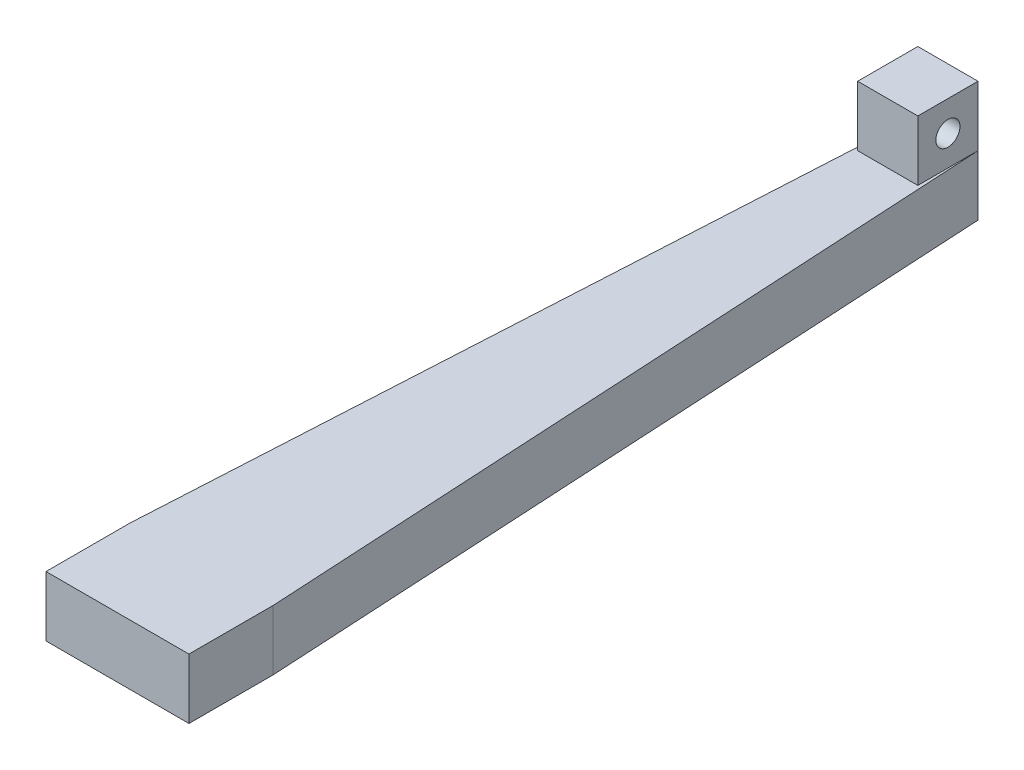
ISO-10303-21;
HEADER;
FILE_DESCRIPTION(('STEP AP214'),'2;1');
FILE_NAME('part.step','',(''),(''),'','','');
FILE_SCHEMA(('AUTOMOTIVE_DESIGN { 1 0 10303 214 1 1 1 1 }'));
ENDSEC;
DATA;
#1=APPLICATION_CONTEXT('core data for automotive mechanical design processes');
#2=APPLICATION_PROTOCOL_DEFINITION('international standard','automotive_design',2000,#1);
#3=PRODUCT_CONTEXT('',#1,'mechanical');
#4=PRODUCT('Part','Part','',(#3));
#5=PRODUCT_RELATED_PRODUCT_CATEGORY('part','',(#4));
#6=PRODUCT_DEFINITION_FORMATION('','',#4);
#7=PRODUCT_DEFINITION_CONTEXT('part definition',#1,'design');
#8=PRODUCT_DEFINITION('design','',#6,#7);
#9=PRODUCT_DEFINITION_SHAPE('','',#8);
#10=(LENGTH_UNIT() NAMED_UNIT(*) SI_UNIT(.MILLI.,.METRE.));
#11=(NAMED_UNIT(*) PLANE_ANGLE_UNIT() SI_UNIT($,.RADIAN.));
#12=(NAMED_UNIT(*) SI_UNIT($,.STERADIAN.) SOLID_ANGLE_UNIT());
#13=UNCERTAINTY_MEASURE_WITH_UNIT(LENGTH_MEASURE(1.E-05),#10,'distance_accuracy_value','');
#14=(GEOMETRIC_REPRESENTATION_CONTEXT(3) GLOBAL_UNCERTAINTY_ASSIGNED_CONTEXT((#13)) GLOBAL_UNIT_ASSIGNED_CONTEXT((#10,
#11,#12)) REPRESENTATION_CONTEXT('',''));
#15=CARTESIAN_POINT('',(0.,0.,0.));
#16=DIRECTION('',(0.,0.,1.));
#17=DIRECTION('',(1.,0.,0.));
#18=AXIS2_PLACEMENT_3D('',#15,#16,#17);
#19=CARTESIAN_POINT('',(0.,-4.72649901887386,0.));
#20=DIRECTION('',(0.,-1.,0.));
#21=DIRECTION('',(0.,0.,-1.));
#22=AXIS2_PLACEMENT_3D('',#19,#20,#21);
#23=PLANE('',#22);
#24=DIRECTION('',(0.,0.,1.));
#25=VECTOR('',#24,1.);
#26=CARTESIAN_POINT('',(-6.25,-4.72649901887386,-86.275));
#27=LINE('',#26,#25);
#28=CARTESIAN_POINT('',(-6.25,-4.72649901887386,-86.275));
#29=VERTEX_POINT('',#28);
#30=CARTESIAN_POINT('',(-6.25,-4.72649901887386,-73.775));
#31=VERTEX_POINT('',#30);
#32=EDGE_CURVE('E75',#29,#31,#27,.T.);
#33=ORIENTED_EDGE('',*,*,#32,.F.);
#34=DIRECTION('',(-0.0553808552337029,0.,0.998465302789027));
#35=VECTOR('',#34,1.);
#36=CARTESIAN_POINT('',(-11.0014815331256,-4.72649901887386,-0.610207940566787));
#37=LINE('',#36,#35);
#38=CARTESIAN_POINT('',(-14.85,-4.72649901887386,68.775));
#39=VERTEX_POINT('',#38);
#40=EDGE_CURVE('E122',#29,#39,#37,.T.);
#41=ORIENTED_EDGE('',*,*,#40,.T.);
#42=DIRECTION('',(0.,0.,1.));
#43=VECTOR('',#42,1.);
#44=CARTESIAN_POINT('',(-14.85,-4.72649901887386,0.));
#45=LINE('',#44,#43);
#46=CARTESIAN_POINT('',(-14.85,-4.72649901887386,86.275));
#47=VERTEX_POINT('',#46);
#48=EDGE_CURVE('E117',#39,#47,#45,.T.);
#49=ORIENTED_EDGE('',*,*,#48,.T.);
#50=DIRECTION('',(1.,0.,0.));
#51=VECTOR('',#50,1.);
#52=CARTESIAN_POINT('',(0.,-4.72649901887386,86.275));
#53=LINE('',#52,#51);
#54=CARTESIAN_POINT('',(14.85,-4.72649901887386,86.275));
#55=VERTEX_POINT('',#54);
#56=EDGE_CURVE('E120',#47,#55,#53,.T.);
#57=ORIENTED_EDGE('',*,*,#56,.T.);
#58=DIRECTION('',(0.,0.,-1.));
#59=VECTOR('',#58,1.);
#60=CARTESIAN_POINT('',(14.85,-4.72649901887386,0.));
#61=LINE('',#60,#59);
#62=CARTESIAN_POINT('',(14.85,-4.72649901887386,68.775));
#63=VERTEX_POINT('',#62);
#64=EDGE_CURVE('E139',#55,#63,#61,.T.);
#65=ORIENTED_EDGE('',*,*,#64,.T.);
#66=DIRECTION('',(-0.0553808552337029,0.,-0.998465302789027));
#67=VECTOR('',#66,1.);
#68=CARTESIAN_POINT('',(11.0014815331256,-4.72649901887386,-0.610207940566787));
#69=LINE('',#68,#67);
#70=CARTESIAN_POINT('',(6.25,-4.72649901887386,-86.275));
#71=VERTEX_POINT('',#70);
#72=EDGE_CURVE('E106',#63,#71,#69,.T.);
#73=ORIENTED_EDGE('',*,*,#72,.T.);
#74=DIRECTION('',(0.,0.,-1.));
#75=VECTOR('',#74,1.);
#76=CARTESIAN_POINT('',(6.25,-4.72649901887386,-86.275));
#77=LINE('',#76,#75);
#78=CARTESIAN_POINT('',(6.25,-4.72649901887386,-73.775));
#79=VERTEX_POINT('',#78);
#80=EDGE_CURVE('E194',#79,#71,#77,.T.);
#81=ORIENTED_EDGE('',*,*,#80,.F.);
#82=DIRECTION('',(1.,0.,0.));
#83=VECTOR('',#82,1.);
#84=CARTESIAN_POINT('',(-6.25,-4.72649901887386,-73.775));
#85=LINE('',#84,#83);
#86=EDGE_CURVE('E69',#31,#79,#85,.T.);
#87=ORIENTED_EDGE('',*,*,#86,.F.);
#88=EDGE_LOOP('',(#33,#41,#49,#57,#65,#73,#81,#87));
#89=FACE_BOUND('',#88,.T.);
#90=ADVANCED_FACE('F52',(#89),#23,.F.);
#91=CARTESIAN_POINT('',(0.,-4.72649901887386,-86.275));
#92=DIRECTION('',(0.,0.,-1.));
#93=DIRECTION('',(-1.,0.,0.));
#94=AXIS2_PLACEMENT_3D('',#91,#92,#93);
#95=PLANE('',#94);
#96=DIRECTION('',(1.,0.,0.));
#97=VECTOR('',#96,1.);
#98=CARTESIAN_POINT('',(0.,-17.2264990188739,-86.275));
#99=LINE('',#98,#97);
#100=CARTESIAN_POINT('',(-6.25,-17.2264990188739,-86.275));
#101=VERTEX_POINT('',#100);
#102=CARTESIAN_POINT('',(6.25,-17.2264990188739,-86.275));
#103=VERTEX_POINT('',#102);
#104=EDGE_CURVE('E145',#101,#103,#99,.T.);
#105=ORIENTED_EDGE('',*,*,#104,.F.);
#106=DIRECTION('',(0.,-1.,0.));
#107=VECTOR('',#106,1.);
#108=CARTESIAN_POINT('',(-6.25,-4.72649901887386,-86.275));
#109=LINE('',#108,#107);
#110=EDGE_CURVE('E12',#29,#101,#109,.T.);
#111=ORIENTED_EDGE('',*,*,#110,.F.);
#112=DIRECTION('',(0.,-1.,0.));
#113=VECTOR('',#112,1.);
#114=CARTESIAN_POINT('',(-6.25,7.77350098112614,-86.275));
#115=LINE('',#114,#113);
#116=CARTESIAN_POINT('',(-6.25,7.77350098112614,-86.275));
#117=VERTEX_POINT('',#116);
#118=EDGE_CURVE('E181',#117,#29,#115,.T.);
#119=ORIENTED_EDGE('',*,*,#118,.F.);
#120=DIRECTION('',(-1.,0.,0.));
#121=VECTOR('',#120,1.);
#122=CARTESIAN_POINT('',(-6.25,7.77350098112614,-86.275));
#123=LINE('',#122,#121);
#124=CARTESIAN_POINT('',(6.25,7.77350098112614,-86.275));
#125=VERTEX_POINT('',#124);
#126=EDGE_CURVE('E186',#125,#117,#123,.T.);
#127=ORIENTED_EDGE('',*,*,#126,.F.);
#128=DIRECTION('',(0.,-1.,0.));
#129=VECTOR('',#128,1.);
#130=CARTESIAN_POINT('',(6.25,7.77350098112614,-86.275));
#131=LINE('',#130,#129);
#132=EDGE_CURVE('E170',#125,#71,#131,.T.);
#133=ORIENTED_EDGE('',*,*,#132,.T.);
#134=DIRECTION('',(0.,-1.,0.));
#135=VECTOR('',#134,1.);
#136=CARTESIAN_POINT('',(6.25,-4.72649901887386,-86.275));
#137=LINE('',#136,#135);
#138=EDGE_CURVE('E56',#71,#103,#137,.T.);
#139=ORIENTED_EDGE('',*,*,#138,.T.);
#140=EDGE_LOOP('',(#105,#111,#119,#127,#133,#139));
#141=FACE_BOUND('',#140,.T.);
#142=ADVANCED_FACE('F54',(#141),#95,.T.);
#143=CARTESIAN_POINT('',(-11.0014815331256,-4.72649901887386,-0.610207940566787));
#144=DIRECTION('',(0.998465302789027,0.,0.0553808552337029));
#145=DIRECTION('',(0.0553808552337029,0.,-0.998465302789027));
#146=AXIS2_PLACEMENT_3D('',#143,#144,#145);
#147=PLANE('',#146);
#148=DIRECTION('',(-0.0553808552337029,0.,0.998465302789027));
#149=VECTOR('',#148,1.);
#150=CARTESIAN_POINT('',(-11.0014815331256,-17.2264990188739,-0.610207940566787));
#151=LINE('',#150,#149);
#152=CARTESIAN_POINT('',(-14.85,-17.2264990188739,68.775));
#153=VERTEX_POINT('',#152);
#154=EDGE_CURVE('E157',#101,#153,#151,.T.);
#155=ORIENTED_EDGE('',*,*,#154,.T.);
#156=DIRECTION('',(0.,-1.,0.));
#157=VECTOR('',#156,1.);
#158=CARTESIAN_POINT('',(-14.85,-4.72649901887386,68.775));
#159=LINE('',#158,#157);
#160=EDGE_CURVE('E61',#39,#153,#159,.T.);
#161=ORIENTED_EDGE('',*,*,#160,.F.);
#162=ORIENTED_EDGE('',*,*,#40,.F.);
#163=ORIENTED_EDGE('',*,*,#110,.T.);
#164=EDGE_LOOP('',(#155,#161,#162,#163));
#165=FACE_BOUND('',#164,.T.);
#166=ADVANCED_FACE('F176',(#165),#147,.F.);
#167=CARTESIAN_POINT('',(-14.85,-4.72649901887386,0.));
#168=DIRECTION('',(1.,0.,0.));
#169=DIRECTION('',(0.,0.,-1.));
#170=AXIS2_PLACEMENT_3D('',#167,#168,#169);
#171=PLANE('',#170);
#172=DIRECTION('',(0.,0.,1.));
#173=VECTOR('',#172,1.);
#174=CARTESIAN_POINT('',(-14.85,-17.2264990188739,0.));
#175=LINE('',#174,#173);
#176=CARTESIAN_POINT('',(-14.85,-17.2264990188739,86.275));
#177=VERTEX_POINT('',#176);
#178=EDGE_CURVE('E131',#153,#177,#175,.T.);
#179=ORIENTED_EDGE('',*,*,#178,.T.);
#180=DIRECTION('',(0.,-1.,0.));
#181=VECTOR('',#180,1.);
#182=CARTESIAN_POINT('',(-14.85,-4.72649901887386,86.275));
#183=LINE('',#182,#181);
#184=EDGE_CURVE('E128',#47,#177,#183,.T.);
#185=ORIENTED_EDGE('',*,*,#184,.F.);
#186=ORIENTED_EDGE('',*,*,#48,.F.);
#187=ORIENTED_EDGE('',*,*,#160,.T.);
#188=EDGE_LOOP('',(#179,#185,#186,#187));
#189=FACE_BOUND('',#188,.T.);
#190=ADVANCED_FACE('F129',(#189),#171,.F.);
#191=CARTESIAN_POINT('',(0.,-4.72649901887386,86.275));
#192=DIRECTION('',(0.,0.,-1.));
#193=DIRECTION('',(-1.,0.,0.));
#194=AXIS2_PLACEMENT_3D('',#191,#192,#193);
#195=PLANE('',#194);
#196=DIRECTION('',(1.,0.,0.));
#197=VECTOR('',#196,1.);
#198=CARTESIAN_POINT('',(0.,-17.2264990188739,86.275));
#199=LINE('',#198,#197);
#200=CARTESIAN_POINT('',(14.85,-17.2264990188739,86.275));
#201=VERTEX_POINT('',#200);
#202=EDGE_CURVE('E154',#177,#201,#199,.T.);
#203=ORIENTED_EDGE('',*,*,#202,.T.);
#204=DIRECTION('',(0.,-1.,0.));
#205=VECTOR('',#204,1.);
#206=CARTESIAN_POINT('',(14.85,-4.72649901887386,86.275));
#207=LINE('',#206,#205);
#208=EDGE_CURVE('E134',#55,#201,#207,.T.);
#209=ORIENTED_EDGE('',*,*,#208,.F.);
#210=ORIENTED_EDGE('',*,*,#56,.F.);
#211=ORIENTED_EDGE('',*,*,#184,.T.);
#212=EDGE_LOOP('',(#203,#209,#210,#211));
#213=FACE_BOUND('',#212,.T.);
#214=ADVANCED_FACE('F136',(#213),#195,.F.);
#215=CARTESIAN_POINT('',(14.85,-4.72649901887386,0.));
#216=DIRECTION('',(-1.,0.,0.));
#217=DIRECTION('',(0.,0.,1.));
#218=AXIS2_PLACEMENT_3D('',#215,#216,#217);
#219=PLANE('',#218);
#220=DIRECTION('',(0.,0.,-1.));
#221=VECTOR('',#220,1.);
#222=CARTESIAN_POINT('',(14.85,-17.2264990188739,0.));
#223=LINE('',#222,#221);
#224=CARTESIAN_POINT('',(14.85,-17.2264990188739,68.775));
#225=VERTEX_POINT('',#224);
#226=EDGE_CURVE('E152',#201,#225,#223,.T.);
#227=ORIENTED_EDGE('',*,*,#226,.T.);
#228=DIRECTION('',(0.,-1.,0.));
#229=VECTOR('',#228,1.);
#230=CARTESIAN_POINT('',(14.85,-4.72649901887386,68.775));
#231=LINE('',#230,#229);
#232=EDGE_CURVE('E160',#63,#225,#231,.T.);
#233=ORIENTED_EDGE('',*,*,#232,.F.);
#234=ORIENTED_EDGE('',*,*,#64,.F.);
#235=ORIENTED_EDGE('',*,*,#208,.T.);
#236=EDGE_LOOP('',(#227,#233,#234,#235));
#237=FACE_BOUND('',#236,.T.);
#238=ADVANCED_FACE('F256',(#237),#219,.F.);
#239=CARTESIAN_POINT('',(11.0014815331256,-4.72649901887386,-0.610207940566787));
#240=DIRECTION('',(-0.998465302789027,0.,0.0553808552337029));
#241=DIRECTION('',(0.0553808552337029,0.,0.998465302789027));
#242=AXIS2_PLACEMENT_3D('',#239,#240,#241);
#243=PLANE('',#242);
#244=DIRECTION('',(-0.0553808552337029,0.,-0.998465302789027));
#245=VECTOR('',#244,1.);
#246=CARTESIAN_POINT('',(11.0014815331256,-17.2264990188739,-0.610207940566787));
#247=LINE('',#246,#245);
#248=EDGE_CURVE('E148',#225,#103,#247,.T.);
#249=ORIENTED_EDGE('',*,*,#248,.T.);
#250=ORIENTED_EDGE('',*,*,#138,.F.);
#251=ORIENTED_EDGE('',*,*,#72,.F.);
#252=ORIENTED_EDGE('',*,*,#232,.T.);
#253=EDGE_LOOP('',(#249,#250,#251,#252));
#254=FACE_BOUND('',#253,.T.);
#255=ADVANCED_FACE('F172',(#254),#243,.F.);
#256=CARTESIAN_POINT('',(0.,-17.2264990188739,0.));
#257=DIRECTION('',(0.,-1.,0.));
#258=DIRECTION('',(0.,0.,-1.));
#259=AXIS2_PLACEMENT_3D('',#256,#257,#258);
#260=PLANE('',#259);
#261=ORIENTED_EDGE('',*,*,#104,.T.);
#262=ORIENTED_EDGE('',*,*,#248,.F.);
#263=ORIENTED_EDGE('',*,*,#226,.F.);
#264=ORIENTED_EDGE('',*,*,#202,.F.);
#265=ORIENTED_EDGE('',*,*,#178,.F.);
#266=ORIENTED_EDGE('',*,*,#154,.F.);
#267=EDGE_LOOP('',(#261,#262,#263,#264,#265,#266));
#268=FACE_BOUND('',#267,.T.);
#269=ADVANCED_FACE('F175',(#268),#260,.T.);
#270=CARTESIAN_POINT('',(-6.25,7.77350098112614,-86.275));
#271=DIRECTION('',(1.,0.,0.));
#272=DIRECTION('',(0.,0.,-1.));
#273=AXIS2_PLACEMENT_3D('',#270,#271,#272);
#274=PLANE('',#273);
#275=CARTESIAN_POINT('',(-6.25,1.52350098112614,-80.025));
#276=DIRECTION('',(-1.,0.,0.));
#277=DIRECTION('',(0.,0.,1.));
#278=AXIS2_PLACEMENT_3D('',#275,#276,#277);
#279=CIRCLE('',#278,2.5);
#280=CARTESIAN_POINT('',(-6.25,1.52350098112614,-77.525));
#281=VERTEX_POINT('',#280);
#282=EDGE_CURVE('E223',#281,#281,#279,.T.);
#283=ORIENTED_EDGE('',*,*,#282,.F.);
#284=EDGE_LOOP('',(#283));
#285=FACE_BOUND('',#284,.T.);
#286=ORIENTED_EDGE('',*,*,#32,.T.);
#287=DIRECTION('',(0.,-1.,0.));
#288=VECTOR('',#287,1.);
#289=CARTESIAN_POINT('',(-6.25,7.77350098112614,-73.775));
#290=LINE('',#289,#288);
#291=CARTESIAN_POINT('',(-6.25,7.77350098112614,-73.775));
#292=VERTEX_POINT('',#291);
#293=EDGE_CURVE('E149',#292,#31,#290,.T.);
#294=ORIENTED_EDGE('',*,*,#293,.F.);
#295=DIRECTION('',(0.,0.,1.));
#296=VECTOR('',#295,1.);
#297=CARTESIAN_POINT('',(-6.25,7.77350098112614,-86.275));
#298=LINE('',#297,#296);
#299=EDGE_CURVE('E185',#117,#292,#298,.T.);
#300=ORIENTED_EDGE('',*,*,#299,.F.);
#301=ORIENTED_EDGE('',*,*,#118,.T.);
#302=EDGE_LOOP('',(#286,#294,#300,#301));
#303=FACE_BOUND('',#302,.T.);
#304=ADVANCED_FACE('F182',(#285,#303),#274,.F.);
#305=CARTESIAN_POINT('',(-6.25,7.77350098112614,-73.775));
#306=DIRECTION('',(0.,0.,-1.));
#307=DIRECTION('',(-1.,0.,0.));
#308=AXIS2_PLACEMENT_3D('',#305,#306,#307);
#309=PLANE('',#308);
#310=ORIENTED_EDGE('',*,*,#86,.T.);
#311=DIRECTION('',(0.,-1.,0.));
#312=VECTOR('',#311,1.);
#313=CARTESIAN_POINT('',(6.25,7.77350098112614,-73.775));
#314=LINE('',#313,#312);
#315=CARTESIAN_POINT('',(6.25,7.77350098112614,-73.775));
#316=VERTEX_POINT('',#315);
#317=EDGE_CURVE('E188',#316,#79,#314,.T.);
#318=ORIENTED_EDGE('',*,*,#317,.F.);
#319=DIRECTION('',(1.,0.,0.));
#320=VECTOR('',#319,1.);
#321=CARTESIAN_POINT('',(-6.25,7.77350098112614,-73.775));
#322=LINE('',#321,#320);
#323=EDGE_CURVE('E205',#292,#316,#322,.T.);
#324=ORIENTED_EDGE('',*,*,#323,.F.);
#325=ORIENTED_EDGE('',*,*,#293,.T.);
#326=EDGE_LOOP('',(#310,#318,#324,#325));
#327=FACE_BOUND('',#326,.T.);
#328=ADVANCED_FACE('F201',(#327),#309,.F.);
#329=CARTESIAN_POINT('',(6.25,7.77350098112614,-86.275));
#330=DIRECTION('',(-1.,0.,0.));
#331=DIRECTION('',(0.,0.,1.));
#332=AXIS2_PLACEMENT_3D('',#329,#330,#331);
#333=PLANE('',#332);
#334=CARTESIAN_POINT('',(6.25,1.52350098112614,-80.025));
#335=DIRECTION('',(-1.,0.,0.));
#336=DIRECTION('',(0.,0.,1.));
#337=AXIS2_PLACEMENT_3D('',#334,#335,#336);
#338=CIRCLE('',#337,2.5);
#339=CARTESIAN_POINT('',(6.25,1.52350098112614,-77.525));
#340=VERTEX_POINT('',#339);
#341=EDGE_CURVE('E219',#340,#340,#338,.T.);
#342=ORIENTED_EDGE('',*,*,#341,.T.);
#343=EDGE_LOOP('',(#342));
#344=FACE_BOUND('',#343,.T.);
#345=ORIENTED_EDGE('',*,*,#80,.T.);
#346=ORIENTED_EDGE('',*,*,#132,.F.);
#347=DIRECTION('',(0.,0.,-1.));
#348=VECTOR('',#347,1.);
#349=CARTESIAN_POINT('',(6.25,7.77350098112614,-86.275));
#350=LINE('',#349,#348);
#351=EDGE_CURVE('E191',#316,#125,#350,.T.);
#352=ORIENTED_EDGE('',*,*,#351,.F.);
#353=ORIENTED_EDGE('',*,*,#317,.T.);
#354=EDGE_LOOP('',(#345,#346,#352,#353));
#355=FACE_BOUND('',#354,.T.);
#356=ADVANCED_FACE('F217',(#344,#355),#333,.F.);
#357=CARTESIAN_POINT('',(0.,7.77350098112614,0.));
#358=DIRECTION('',(0.,1.,0.));
#359=DIRECTION('',(0.,0.,1.));
#360=AXIS2_PLACEMENT_3D('',#357,#358,#359);
#361=PLANE('',#360);
#362=ORIENTED_EDGE('',*,*,#299,.T.);
#363=ORIENTED_EDGE('',*,*,#323,.T.);
#364=ORIENTED_EDGE('',*,*,#351,.T.);
#365=ORIENTED_EDGE('',*,*,#126,.T.);
#366=EDGE_LOOP('',(#362,#363,#364,#365));
#367=FACE_BOUND('',#366,.T.);
#368=ADVANCED_FACE('F213',(#367),#361,.T.);
#369=CARTESIAN_POINT('',(6.25,1.52350098112614,-80.025));
#370=DIRECTION('',(-1.,0.,0.));
#371=DIRECTION('',(0.,0.,1.));
#372=AXIS2_PLACEMENT_3D('',#369,#370,#371);
#373=CYLINDRICAL_SURFACE('',#372,2.5);
#374=ORIENTED_EDGE('',*,*,#341,.F.);
#375=EDGE_LOOP('',(#374));
#376=FACE_BOUND('',#375,.T.);
#377=ORIENTED_EDGE('',*,*,#282,.T.);
#378=EDGE_LOOP('',(#377));
#379=FACE_BOUND('',#378,.T.);
#380=ADVANCED_FACE('F230',(#376,#379),#373,.F.);
#381=CLOSED_SHELL('',(#90,#142,#166,#190,#214,#238,#255,#269,#304,#328,#356,#368,#380));
#382=MANIFOLD_SOLID_BREP('B2',#381);
#383=ADVANCED_BREP_SHAPE_REPRESENTATION('',(#18,#382),#14);
#384=SHAPE_DEFINITION_REPRESENTATION(#9,#383);
ENDSEC;
END-ISO-10303-21;
